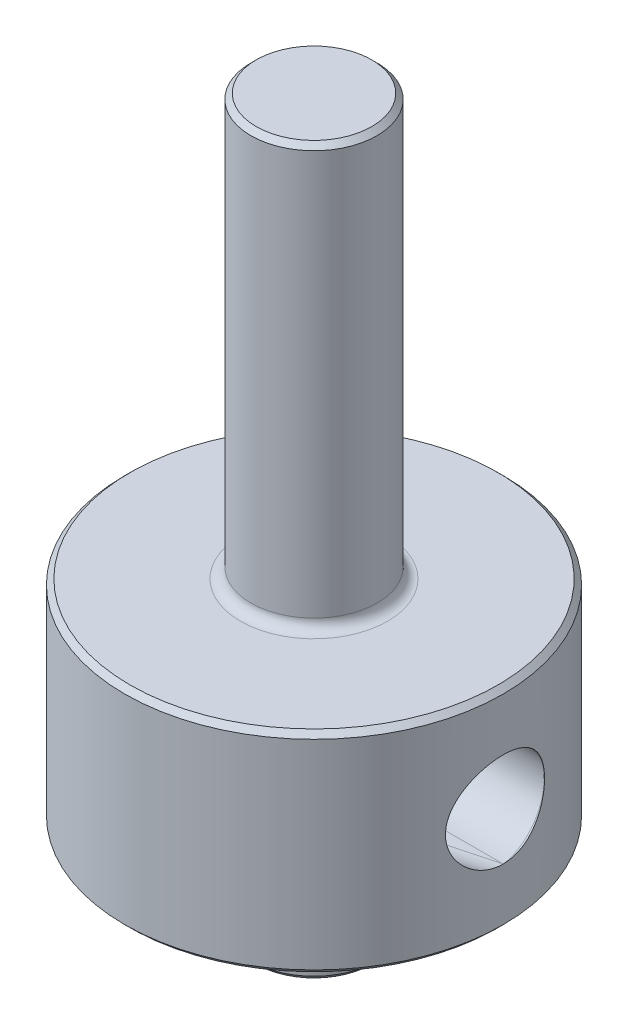
ISO-10303-21;
HEADER;
FILE_DESCRIPTION(('STEP AP214'),'2;1');
FILE_NAME('part.step','',(''),(''),'','','');
FILE_SCHEMA(('AUTOMOTIVE_DESIGN { 1 0 10303 214 1 1 1 1 }'));
ENDSEC;
DATA;
#1=APPLICATION_CONTEXT('core data for automotive mechanical design processes');
#2=APPLICATION_PROTOCOL_DEFINITION('international standard','automotive_design',2000,#1);
#3=PRODUCT_CONTEXT('',#1,'mechanical');
#4=PRODUCT('Part','Part','',(#3));
#5=PRODUCT_RELATED_PRODUCT_CATEGORY('part','',(#4));
#6=PRODUCT_DEFINITION_FORMATION('','',#4);
#7=PRODUCT_DEFINITION_CONTEXT('part definition',#1,'design');
#8=PRODUCT_DEFINITION('design','',#6,#7);
#9=PRODUCT_DEFINITION_SHAPE('','',#8);
#10=(LENGTH_UNIT() NAMED_UNIT(*) SI_UNIT(.MILLI.,.METRE.));
#11=(NAMED_UNIT(*) PLANE_ANGLE_UNIT() SI_UNIT($,.RADIAN.));
#12=(NAMED_UNIT(*) SI_UNIT($,.STERADIAN.) SOLID_ANGLE_UNIT());
#13=UNCERTAINTY_MEASURE_WITH_UNIT(LENGTH_MEASURE(1.E-05),#10,'distance_accuracy_value','');
#14=(GEOMETRIC_REPRESENTATION_CONTEXT(3) GLOBAL_UNCERTAINTY_ASSIGNED_CONTEXT((#13)) GLOBAL_UNIT_ASSIGNED_CONTEXT((#10,
#11,#12)) REPRESENTATION_CONTEXT('',''));
#15=CARTESIAN_POINT('',(0.,0.,0.));
#16=DIRECTION('',(0.,0.,1.));
#17=DIRECTION('',(1.,0.,0.));
#18=AXIS2_PLACEMENT_3D('',#15,#16,#17);
#19=CARTESIAN_POINT('',(11.25,0.,-0.602885682970027));
#20=DIRECTION('',(-0.965925826289068,0.,0.258819045102521));
#21=DIRECTION('',(0.258819045102521,0.,0.965925826289068));
#22=AXIS2_PLACEMENT_3D('',#19,#20,#21);
#23=CYLINDRICAL_SURFACE('',#22,2.25);
#24=DIRECTION('',(0.965925826289068,0.,-0.258819045102521));
#25=VECTOR('',#24,1.);
#26=CARTESIAN_POINT('',(-10.4287614698095,-2.25,5.20592094577239));
#27=LINE('',#26,#25);
#28=CARTESIAN_POINT('',(-7.79422863405994,-2.25,4.50000000000001));
#29=VERTEX_POINT('',#28);
#30=CARTESIAN_POINT('',(9.,-2.25,0.));
#31=VERTEX_POINT('',#30);
#32=EDGE_CURVE('E66',#29,#31,#27,.T.);
#33=ORIENTED_EDGE('',*,*,#32,.F.);
#34=CARTESIAN_POINT('',(-6.2986309684237,0.,6.42862721921359));
#35=CARTESIAN_POINT('',(-6.29863572562921,0.115420645557257,6.42862440706099));
#36=CARTESIAN_POINT('',(-6.3060602838156,0.230878962906398,6.42137370973188));
#37=CARTESIAN_POINT('',(-6.33512109848462,0.458218917145718,6.39270188036306));
#38=CARTESIAN_POINT('',(-6.3567683340453,0.570097720835036,6.37126980103204));
#39=CARTESIAN_POINT('',(-6.41242453029494,0.78670447934925,6.31524720562879));
#40=CARTESIAN_POINT('',(-6.44638221658226,0.891459984994621,6.2807112412774));
#41=CARTESIAN_POINT('',(-6.52441532590811,1.09212368629617,6.19960971245666));
#42=CARTESIAN_POINT('',(-6.56849300705771,1.18802990067239,6.15304146288881));
#43=CARTESIAN_POINT('',(-6.66787542719835,1.37599197932501,6.04526066182345));
#44=CARTESIAN_POINT('',(-6.72376022801728,1.46727267152965,5.98323478487839));
#45=CARTESIAN_POINT('',(-6.84174874506253,1.63651923315656,5.8479513900165));
#46=CARTESIAN_POINT('',(-6.90385527941814,1.71447902523652,5.77468877437664));
#47=CARTESIAN_POINT('',(-7.03939861788815,1.86424788131121,5.60888743463547));
#48=CARTESIAN_POINT('',(-7.11330801596242,1.93424855635128,5.51509447487221));
#49=CARTESIAN_POINT('',(-7.26276858582111,2.05452364569838,5.31673000401393));
#50=CARTESIAN_POINT('',(-7.33832026687979,2.1047918461138,5.2121551106831));
#51=CARTESIAN_POINT('',(-7.49057807446588,2.18518458802696,4.99097133267823));
#52=CARTESIAN_POINT('',(-7.56724722608848,2.2146353310375,4.87408964345249));
#53=CARTESIAN_POINT('',(-7.71646007617075,2.24913379886119,4.63423781835183));
#54=CARTESIAN_POINT('',(-7.78900533974565,2.25419084360776,4.51127002589661));
#55=CARTESIAN_POINT('',(-7.92385182822738,2.23921005722015,4.26974209030992));
#56=CARTESIAN_POINT('',(-7.98649124915509,2.22047892995192,4.15129057209001));
#57=CARTESIAN_POINT('',(-8.10419519406083,2.15996401217146,3.91653502097405));
#58=CARTESIAN_POINT('',(-8.15926253547756,2.11818882510589,3.80023020334988));
#59=CARTESIAN_POINT('',(-8.25776113353527,2.01560967239164,3.58092038777548));
#60=CARTESIAN_POINT('',(-8.30169093853679,1.95609127547807,3.47753592764894));
#61=CARTESIAN_POINT('',(-8.38164675783941,1.81895528829501,3.28014439330143));
#62=CARTESIAN_POINT('',(-8.4176735688114,1.74133952398132,3.18613637439842));
#63=CARTESIAN_POINT('',(-8.4813766537205,1.57178662880977,3.0124201997295));
#64=CARTESIAN_POINT('',(-8.50919398505658,1.48013832272008,2.93248136388814));
#65=CARTESIAN_POINT('',(-8.55778682532547,1.28408324493627,2.78749818442494));
#66=CARTESIAN_POINT('',(-8.5785620965331,1.17967604269037,2.72245434365095));
#67=CARTESIAN_POINT('',(-8.61377201375056,0.960065530946159,2.608929002455));
#68=CARTESIAN_POINT('',(-8.62815045340775,0.844776908229934,2.56059511952854));
#69=CARTESIAN_POINT('',(-8.65083340110135,0.607411382763265,2.48288750415837));
#70=CARTESIAN_POINT('',(-8.65913768828506,0.48533423335953,2.45351446112445));
#71=CARTESIAN_POINT('',(-8.67008048728678,0.236857570319108,2.41456499172959));
#72=CARTESIAN_POINT('',(-8.67267544790419,0.110432252928291,2.40514075696676));
#73=CARTESIAN_POINT('',(-8.67219751366162,-0.142268545365695,2.40686318857274));
#74=CARTESIAN_POINT('',(-8.66912451553204,-0.268544023496865,2.41801022974793));
#75=CARTESIAN_POINT('',(-8.65715387573318,-0.51751785461279,2.46052203867228));
#76=CARTESIAN_POINT('',(-8.64824925913011,-0.640211740022708,2.49191101619238));
#77=CARTESIAN_POINT('',(-8.62421236615811,-0.878377270072895,2.57386329992728));
#78=CARTESIAN_POINT('',(-8.60908000496078,-0.993848816312671,2.6244268673193));
#79=CARTESIAN_POINT('',(-8.57205213944146,-1.21415256544937,2.74294663140657));
#80=CARTESIAN_POINT('',(-8.55016367391666,-1.31899569116797,2.81088471402045));
#81=CARTESIAN_POINT('',(-8.49904486992793,-1.51515452308034,2.96185190294187));
#82=CARTESIAN_POINT('',(-8.46981504685822,-1.60647117817417,3.04487994975732));
#83=CARTESIAN_POINT('',(-8.40384326654009,-1.77231366502419,3.22246844850753));
#84=CARTESIAN_POINT('',(-8.36716006476566,-1.84696178407205,3.31693649876167));
#85=CARTESIAN_POINT('',(-8.28606008973115,-1.97828129373805,3.51462690249678));
#86=CARTESIAN_POINT('',(-8.24164420023817,-2.03495473659138,3.61784825487416));
#87=CARTESIAN_POINT('',(-8.14587050991866,-2.12853459341272,3.82858464031527));
#88=CARTESIAN_POINT('',(-8.09457748565701,-2.1656111713848,3.93605369911621));
#89=CARTESIAN_POINT('',(-7.98560105577117,-2.2201622548549,4.15269515826185));
#90=CARTESIAN_POINT('',(-7.92791726302396,-2.23763557216455,4.26186766144874));
#91=CARTESIAN_POINT('',(-7.8064627399753,-2.2532286711866,4.48051702474105));
#92=CARTESIAN_POINT('',(-7.74260781604153,-2.25102691326248,4.58996960492615));
#93=CARTESIAN_POINT('',(-7.61133141525705,-2.22723790138716,4.80452612877819));
#94=CARTESIAN_POINT('',(-7.54390907227507,-2.20564591918363,4.90962900524241));
#95=CARTESIAN_POINT('',(-7.40368700760956,-2.14247693844326,5.11880139853706));
#96=CARTESIAN_POINT('',(-7.33079536390484,-2.09986710762043,5.22249687911003));
#97=CARTESIAN_POINT('',(-7.18566990287537,-1.99573590270148,5.4204461433094));
#98=CARTESIAN_POINT('',(-7.11343636939443,-1.9342067325446,5.51469601343077));
#99=CARTESIAN_POINT('',(-6.96808985738204,-1.78946346248777,5.6973807162314));
#100=CARTESIAN_POINT('',(-6.89518353138152,-1.70517091423079,5.78512871402776));
#101=CARTESIAN_POINT('',(-6.75667498207226,-1.51863287423206,5.94631447067187));
#102=CARTESIAN_POINT('',(-6.69107582137067,-1.41637990076989,6.01974623884784));
#103=CARTESIAN_POINT('',(-6.57183008781377,-1.19703132919625,6.14969612074954));
#104=CARTESIAN_POINT('',(-6.51807249243096,-1.08009130507524,6.20637320763919));
#105=CARTESIAN_POINT('',(-6.42605821431225,-0.833521771282112,6.30160344845743));
#106=CARTESIAN_POINT('',(-6.38776882517395,-0.703919763209804,6.34019487118341));
#107=CARTESIAN_POINT('',(-6.33934183170501,-0.477861263387974,6.38854526595828));
#108=CARTESIAN_POINT('',(-6.32415889206565,-0.38356198653444,6.40353131951988));
#109=CARTESIAN_POINT('',(-6.30380294632094,-0.192850152597827,6.42357200922269));
#110=CARTESIAN_POINT('',(-6.29862699360223,-0.096438226055408,6.42862956887129));
#111=CARTESIAN_POINT('',(-6.2986309684237,0.,6.42862721921359));
#112=B_SPLINE_CURVE_WITH_KNOTS('',3,(#34,#35,#36,#37,#38,#39,#40,#41,#42,#43,#44,#45,#46,#47,
#48,#49,#50,#51,#52,#53,#54,#55,#56,#57,#58,#59,#60,#61,#62,#63,#64,#65,#66,#67,#68,#69,#70,#71,
#72,#73,#74,#75,#76,#77,#78,#79,#80,#81,#82,#83,#84,#85,#86,#87,#88,#89,#90,#91,#92,#93,#94,#95,
#96,#97,#98,#99,#100,#101,#102,#103,#104,#105,#106,#107,#108,#109,#110,#111),.UNSPECIFIED.,.T.,
.F.,(4,2,2,2,2,2,2,2,2,2,2,2,2,2,2,2,2,2,2,2,2,2,2,2,2,2,2,2,2,2,2,2,2,2,2,2,2,2,4),(0.,
0.345877961457703,0.692023234739048,1.03674303415902,1.38153982703779,1.75117699978304,
2.12098236297531,2.53438092029154,2.94790955541439,3.37427601824992,3.8004795692583,
4.204252580168,4.6078749452831,4.98738996171283,5.36686670307259,5.73938241737213,
6.11191070576972,6.48765054778276,6.86340405080125,7.24201403637019,7.62063092023952,
7.99970147963442,8.37877720253762,8.757459313711,9.13611484723242,9.51189379136419,
9.88762981596775,10.2600472924912,10.6324873406787,11.0110249766264,11.389654942997,
11.7890874589759,12.1886847895261,12.6122260505673,13.0359441651727,13.455502400953,
13.8741688086731,14.1632477952196,14.452241647867),.UNSPECIFIED.);
#113=CARTESIAN_POINT('',(-7.79422863405994,2.25,4.50000000000001));
#114=VERTEX_POINT('',#113);
#115=EDGE_CURVE('E98',#29,#114,#112,.T.);
#116=ORIENTED_EDGE('',*,*,#115,.T.);
#117=DIRECTION('',(0.965925826289068,0.,-0.258819045102521));
#118=VECTOR('',#117,1.);
#119=CARTESIAN_POINT('',(-10.4287614698095,2.25,5.20592094577239));
#120=LINE('',#119,#118);
#121=CARTESIAN_POINT('',(9.,2.25,0.));
#122=VERTEX_POINT('',#121);
#123=EDGE_CURVE('E94',#114,#122,#120,.T.);
#124=ORIENTED_EDGE('',*,*,#123,.T.);
#125=CARTESIAN_POINT('',(8.66908803732511,0.,2.41803899908722));
#126=CARTESIAN_POINT('',(8.66909075110963,-0.115420645557257,2.41803418508887));
#127=CARTESIAN_POINT('',(8.67189525844636,-0.230878962906399,2.40804261791352));
#128=CARTESIAN_POINT('',(8.68272674751999,-0.458218917145718,2.36868167797264));
#129=CARTESIAN_POINT('',(8.69075776377174,-0.570097720835037,2.33929733503571));
#130=CARTESIAN_POINT('',(8.71094614590031,-0.786704479349251,2.26295224610574));
#131=CARTESIAN_POINT('',(8.72308638270318,-0.891459984994622,2.21606438048958));
#132=CARTESIAN_POINT('',(8.75011427330529,-1.09212368629617,2.10681184158214));
#133=CARTESIAN_POINT('',(8.76500254013682,-1.18802990067239,2.04444371387181));
#134=CARTESIAN_POINT('',(8.79717984013551,-1.37599197932501,1.90141159203865));
#135=CARTESIAN_POINT('',(8.81456455885762,-1.46727267152965,1.81975320650276));
#136=CARTESIAN_POINT('',(8.84910391454271,-1.63651923315656,1.64360009131953));
#137=CARTESIAN_POINT('',(8.86625844321575,-1.71447902523652,1.54909953784991));
#138=CARTESIAN_POINT('',(8.90074174777394,-1.86424788131121,1.33773969641756));
#139=CARTESIAN_POINT('',(8.91785268420305,-1.93424855635128,1.21955791152931));
#140=CARTESIAN_POINT('',(8.94810709913564,-2.05452364569838,0.973038955628435));
#141=CARTESIAN_POINT('',(8.96124932756565,-2.1047918461138,0.844698600876546));
#142=CARTESIAN_POINT('',(8.9825165678573,-2.18518458802696,0.577018926426272));
#143=CARTESIAN_POINT('',(8.99047315623619,-2.21463533103751,0.437461838508236));
#144=CARTESIAN_POINT('',(8.99976936242818,-2.24913379886119,0.155137639785871));
#145=CARTESIAN_POINT('',(9.00111150738068,-2.25419084360776,0.0123717758849108));
#146=CARTESIAN_POINT('',(8.99712802422364,-2.23921005722015,-0.264220796297641));
#147=CARTESIAN_POINT('',(8.99214959491542,-2.22047892995192,-0.398122530656776));
#148=CARTESIAN_POINT('',(8.97670642577146,-2.15996401217146,-0.660278774055481));
#149=CARTESIAN_POINT('',(8.96624373354513,-2.11818882510589,-0.788535371408894));
#150=CARTESIAN_POINT('',(8.94189111391307,-2.01560967239164,-1.02771254202446));
#151=CARTESIAN_POINT('',(8.92824321096441,-1.95609127547807,-1.13921101335134));
#152=CARTESIAN_POINT('',(8.89879121448712,-1.81895528829501,-1.35013500623958));
#153=CARTESIAN_POINT('',(8.8829873385547,-1.74133952398132,-1.44956174425504));
#154=CARTESIAN_POINT('',(8.85129774105095,-1.57178662880977,-1.63185590702113));
#155=CARTESIAN_POINT('',(8.83541883873281,-1.48013832272008,-1.71499363527673));
#156=CARTESIAN_POINT('',(8.80500988311611,-1.28408324493627,-1.86484917194776));
#157=CARTESIAN_POINT('',(8.79047987536543,-1.17967604269037,-1.93156642602155));
#158=CARTESIAN_POINT('',(8.76420988754292,-0.960065530946158,-2.04748721407927));
#159=CARTESIAN_POINT('',(8.7524950400896,-0.844776908229933,-2.09653480438572));
#160=CARTESIAN_POINT('',(8.73328524133988,-0.607411382763264,-2.1751730472106));
#161=CARTESIAN_POINT('',(8.72579044348435,-0.485334233359529,-2.20476299225628));
#162=CARTESIAN_POINT('',(8.7157924507109,-0.236857570319107,-2.24396562171702));
#163=CARTESIAN_POINT('',(8.71332763514599,-0.110432252928291,-2.25342472874156));
#164=CARTESIAN_POINT('',(8.71377494775357,0.142268545365696,-2.25169409209321));
#165=CARTESIAN_POINT('',(8.71668717389518,0.268544023496866,-2.24050397219368));
#166=CARTESIAN_POINT('',(8.72757620019198,0.517517854612791,-2.19770234580494));
#167=CARTESIAN_POINT('',(8.73555906476282,0.64021174002271,-2.16606638557217));
#168=CARTESIAN_POINT('',(8.75571864668846,0.878377270072896,-2.08307517947359));
#169=CARTESIAN_POINT('',(8.76789542116834,0.993848816312672,-2.03171966500748));
#170=CARTESIAN_POINT('',(8.79508823102433,1.21415256544937,-1.91056460569769));
#171=CARTESIAN_POINT('',(8.81010130513694,1.31899569116797,-1.84078426750727));
#172=CARTESIAN_POINT('',(8.84131471673233,1.51515452308034,-1.68448344476903));
#173=CARTESIAN_POINT('',(8.85751497081356,1.60647117817417,-1.5979641354654));
#174=CARTESIAN_POINT('',(8.88917598250028,1.77231366502419,-1.41118209396871));
#175=CARTESIAN_POINT('',(8.90464142299854,1.84696178407205,-1.31102876171542));
#176=CARTESIAN_POINT('',(8.93325198623993,1.97828129373805,-1.09927386247916));
#177=CARTESIAN_POINT('',(8.94639737379601,2.03495473659138,-0.987673604360878));
#178=CARTESIAN_POINT('',(8.96882311768569,2.12853459341272,-0.757283695907411));
#179=CARTESIAN_POINT('',(8.97813658503864,2.1656111713848,-0.638566248734169));
#180=CARTESIAN_POINT('',(8.99208095791658,2.2201622548549,-0.396461026658194));
#181=CARTESIAN_POINT('',(8.99671157960431,2.23763557216455,-0.273072969130007));
#182=CARTESIAN_POINT('',(9.00085355888581,2.2532286711866,-0.0229898044732395));
#183=CARTESIAN_POINT('',(9.00027986269499,2.25102691326248,0.103726372443697));
#184=CARTESIAN_POINT('',(8.99386942662426,2.22723790138717,0.355175973039477));
#185=CARTESIAN_POINT('',(8.98803140305131,2.20564591918363,0.479908905559302));
#186=CARTESIAN_POINT('',(8.9711817295272,2.14247693844326,0.731168544255609));
#187=CARTESIAN_POINT('',(8.9599034546418,2.09986710762043,0.857417286541805));
#188=CARTESIAN_POINT('',(8.93319575075403,1.99573590270148,1.10140910851363));
#189=CARTESIAN_POINT('',(8.91776461081511,1.9342067325446,1.21914865708259));
#190=CARTESIAN_POINT('',(8.88323319046123,1.78946346248777,1.45003150659694));
#191=CARTESIAN_POINT('',(8.86396845894638,1.70517091423079,1.56247666482007));
#192=CARTESIAN_POINT('',(8.82460941492528,1.51863287423205,1.77132189945671));
#193=CARTESIAN_POINT('',(8.80451475937875,1.41637990076989,1.86771525649271));
#194=CARTESIAN_POINT('',(8.76621986577641,1.19703132919625,2.03987802221683));
#195=CARTESIAN_POINT('',(8.74800296597337,1.08009130507523,2.11584061696716));
#196=CARTESIAN_POINT('',(8.71593138402079,0.83352177128211,2.24431956378361));
#197=CARTESIAN_POINT('',(8.70206751169463,0.703919763209803,2.29688541080165));
#198=CARTESIAN_POINT('',(8.68430370250905,0.477861263387973,2.36297157769416));
#199=CARTESIAN_POINT('',(8.67864791785805,0.383561986534439,2.38354135060067));
#200=CARTESIAN_POINT('',(8.67103949657648,0.192850152597826,2.41107506986501));
#201=CARTESIAN_POINT('',(8.66908576985758,0.0964382260554076,2.41804302136122));
#202=CARTESIAN_POINT('',(8.66908803732511,0.,2.41803899908722));
#203=B_SPLINE_CURVE_WITH_KNOTS('',3,(#125,#126,#127,#128,#129,#130,#131,#132,#133,#134,#135,
#136,#137,#138,#139,#140,#141,#142,#143,#144,#145,#146,#147,#148,#149,#150,#151,#152,#153,#154,
#155,#156,#157,#158,#159,#160,#161,#162,#163,#164,#165,#166,#167,#168,#169,#170,#171,#172,#173,
#174,#175,#176,#177,#178,#179,#180,#181,#182,#183,#184,#185,#186,#187,#188,#189,#190,#191,#192,
#193,#194,#195,#196,#197,#198,#199,#200,#201,#202),.UNSPECIFIED.,.T.,.F.,(4,2,2,2,2,2,2,2,2,2,2,
2,2,2,2,2,2,2,2,2,2,2,2,2,2,2,2,2,2,2,2,2,2,2,2,2,2,2,4),(0.,0.345877961457704,
0.692023234739048,1.03674303415902,1.38153982703779,1.75117699978304,2.12098236297532,
2.53438092029155,2.94790955541439,3.37427601824992,3.8004795692583,4.204252580168,
4.6078749452831,4.98738996171283,5.36686670307259,5.73938241737213,6.11191070576972,
6.48765054778276,6.86340405080125,7.24201403637019,7.62063092023952,7.99970147963442,
8.37877720253762,8.75745931371099,9.13611484723242,9.51189379136419,9.88762981596774,
10.2600472924912,10.6324873406787,11.0110249766264,11.389654942997,11.7890874589759,
12.1886847895261,12.6122260505673,13.0359441651727,13.455502400953,13.8741688086731,
14.1632477952196,14.452241647867),.UNSPECIFIED.);
#204=EDGE_CURVE('E93',#122,#31,#203,.T.);
#205=ORIENTED_EDGE('',*,*,#204,.T.);
#206=EDGE_LOOP('',(#33,#116,#124,#205));
#207=FACE_BOUND('',#206,.T.);
#208=ADVANCED_FACE('F34',(#207),#23,.F.);
#209=CARTESIAN_POINT('',(3.,-9.5,0.));
#210=DIRECTION('',(0.,-1.,0.));
#211=DIRECTION('',(0.,0.,-1.));
#212=AXIS2_PLACEMENT_3D('',#209,#210,#211);
#213=PLANE('',#212);
#214=CARTESIAN_POINT('',(0.,-9.5,0.));
#215=DIRECTION('',(0.,-1.,0.));
#216=DIRECTION('',(0.,0.,-1.));
#217=AXIS2_PLACEMENT_3D('',#214,#215,#216);
#218=CIRCLE('',#217,2.75);
#219=CARTESIAN_POINT('',(0.,-9.5,-2.75));
#220=VERTEX_POINT('',#219);
#221=EDGE_CURVE('E137',#220,#220,#218,.T.);
#222=ORIENTED_EDGE('',*,*,#221,.T.);
#223=EDGE_LOOP('',(#222));
#224=FACE_BOUND('',#223,.T.);
#225=ADVANCED_FACE('F182',(#224),#213,.T.);
#226=CARTESIAN_POINT('',(0.,25.,0.));
#227=DIRECTION('',(0.,1.,0.));
#228=DIRECTION('',(0.,0.,1.));
#229=AXIS2_PLACEMENT_3D('',#226,#227,#228);
#230=PLANE('',#229);
#231=CARTESIAN_POINT('',(0.,25.,0.));
#232=DIRECTION('',(0.,1.,0.));
#233=DIRECTION('',(0.,0.,1.));
#234=AXIS2_PLACEMENT_3D('',#231,#232,#233);
#235=CIRCLE('',#234,2.75);
#236=CARTESIAN_POINT('',(0.,25.,2.75));
#237=VERTEX_POINT('',#236);
#238=EDGE_CURVE('E146',#237,#237,#235,.T.);
#239=ORIENTED_EDGE('',*,*,#238,.T.);
#240=EDGE_LOOP('',(#239));
#241=FACE_BOUND('',#240,.T.);
#242=ADVANCED_FACE('F186',(#241),#230,.T.);
#243=CARTESIAN_POINT('',(0.,0.,0.));
#244=DIRECTION('',(0.,-1.,0.));
#245=DIRECTION('',(0.,0.,-1.));
#246=AXIS2_PLACEMENT_3D('',#243,#244,#245);
#247=CYLINDRICAL_SURFACE('',#246,3.);
#248=CARTESIAN_POINT('',(0.,24.75,0.));
#249=DIRECTION('',(0.,1.,0.));
#250=DIRECTION('',(0.,0.,1.));
#251=AXIS2_PLACEMENT_3D('',#248,#249,#250);
#252=CIRCLE('',#251,3.);
#253=CARTESIAN_POINT('',(0.,24.75,3.));
#254=VERTEX_POINT('',#253);
#255=EDGE_CURVE('E143',#254,#254,#252,.F.);
#256=ORIENTED_EDGE('',*,*,#255,.T.);
#257=EDGE_LOOP('',(#256));
#258=FACE_BOUND('',#257,.T.);
#259=CARTESIAN_POINT('',(0.,5.5,0.));
#260=DIRECTION('',(0.,1.,0.));
#261=DIRECTION('',(0.,0.,1.));
#262=AXIS2_PLACEMENT_3D('',#259,#260,#261);
#263=CIRCLE('',#262,3.);
#264=CARTESIAN_POINT('',(0.,5.5,3.));
#265=VERTEX_POINT('',#264);
#266=EDGE_CURVE('E134',#265,#265,#263,.T.);
#267=ORIENTED_EDGE('',*,*,#266,.T.);
#268=EDGE_LOOP('',(#267));
#269=FACE_BOUND('',#268,.T.);
#270=ADVANCED_FACE('F192',(#258,#269),#247,.T.);
#271=CARTESIAN_POINT('',(9.,5.,0.));
#272=DIRECTION('',(0.,1.,0.));
#273=DIRECTION('',(0.,0.,1.));
#274=AXIS2_PLACEMENT_3D('',#271,#272,#273);
#275=PLANE('',#274);
#276=CARTESIAN_POINT('',(0.,5.,0.));
#277=DIRECTION('',(0.,1.,0.));
#278=DIRECTION('',(0.,0.,1.));
#279=AXIS2_PLACEMENT_3D('',#276,#277,#278);
#280=CIRCLE('',#279,8.75);
#281=CARTESIAN_POINT('',(0.,5.,8.75));
#282=VERTEX_POINT('',#281);
#283=EDGE_CURVE('E11',#282,#282,#280,.T.);
#284=ORIENTED_EDGE('',*,*,#283,.T.);
#285=EDGE_LOOP('',(#284));
#286=FACE_BOUND('',#285,.T.);
#287=CARTESIAN_POINT('',(0.,5.,0.));
#288=DIRECTION('',(0.,1.,0.));
#289=DIRECTION('',(0.,0.,1.));
#290=AXIS2_PLACEMENT_3D('',#287,#288,#289);
#291=CIRCLE('',#290,3.5);
#292=CARTESIAN_POINT('',(0.,5.,3.5));
#293=VERTEX_POINT('',#292);
#294=EDGE_CURVE('E131',#293,#293,#291,.F.);
#295=ORIENTED_EDGE('',*,*,#294,.T.);
#296=EDGE_LOOP('',(#295));
#297=FACE_BOUND('',#296,.T.);
#298=ADVANCED_FACE('F214',(#286,#297),#275,.T.);
#299=CARTESIAN_POINT('',(0.,0.,0.));
#300=DIRECTION('',(0.,-1.,0.));
#301=DIRECTION('',(0.,0.,-1.));
#302=AXIS2_PLACEMENT_3D('',#299,#300,#301);
#303=CYLINDRICAL_SURFACE('',#302,9.);
#304=CARTESIAN_POINT('',(0.,-4.75,0.));
#305=DIRECTION('',(0.,-1.,0.));
#306=DIRECTION('',(0.,0.,-1.));
#307=AXIS2_PLACEMENT_3D('',#304,#305,#306);
#308=CIRCLE('',#307,9.);
#309=CARTESIAN_POINT('',(0.,-4.75,-9.));
#310=VERTEX_POINT('',#309);
#311=EDGE_CURVE('E42',#310,#310,#308,.F.);
#312=ORIENTED_EDGE('',*,*,#311,.T.);
#313=EDGE_LOOP('',(#312));
#314=FACE_BOUND('',#313,.T.);
#315=CARTESIAN_POINT('',(0.,4.75,0.));
#316=DIRECTION('',(0.,1.,0.));
#317=DIRECTION('',(0.,0.,1.));
#318=AXIS2_PLACEMENT_3D('',#315,#316,#317);
#319=CIRCLE('',#318,9.);
#320=CARTESIAN_POINT('',(0.,4.75,9.));
#321=VERTEX_POINT('',#320);
#322=EDGE_CURVE('E152',#321,#321,#319,.F.);
#323=ORIENTED_EDGE('',*,*,#322,.T.);
#324=EDGE_LOOP('',(#323));
#325=FACE_BOUND('',#324,.T.);
#326=CARTESIAN_POINT('',(0.,-2.25,0.));
#327=DIRECTION('',(0.,-1.,0.));
#328=DIRECTION('',(0.,0.,-1.));
#329=AXIS2_PLACEMENT_3D('',#326,#327,#328);
#330=CIRCLE('',#329,9.);
#331=CARTESIAN_POINT('',(-9.,-2.25,0.));
#332=VERTEX_POINT('',#331);
#333=EDGE_CURVE('E49',#332,#29,#330,.F.);
#334=ORIENTED_EDGE('',*,*,#333,.F.);
#335=CARTESIAN_POINT('',(-8.71421252896669,0.,2.25));
#336=CARTESIAN_POINT('',(-8.71421490079074,0.124245675833919,2.24999647073377));
#337=CARTESIAN_POINT('',(-8.71689875413138,0.24853040881067,2.23967362094789));
#338=CARTESIAN_POINT('',(-8.72731675793308,0.493530820356158,2.19872081291741));
#339=CARTESIAN_POINT('',(-8.73505384759467,0.614244379021367,2.16807903606789));
#340=CARTESIAN_POINT('',(-8.75464852136535,0.848523184368464,2.08754207966884));
#341=CARTESIAN_POINT('',(-8.76650078421412,0.962097439847137,2.03767175506904));
#342=CARTESIAN_POINT('',(-8.79298372825883,1.17927976728589,1.92016902713525));
#343=CARTESIAN_POINT('',(-8.8076145274064,1.2828874158722,1.85253586970462));
#344=CARTESIAN_POINT('',(-8.83836644720063,1.47947548073599,1.69983758458069));
#345=CARTESIAN_POINT('',(-8.85451137860731,1.57220424031504,1.61445319893365));
#346=CARTESIAN_POINT('',(-8.88626587963764,1.74218525492431,1.4293638576906));
#347=CARTESIAN_POINT('',(-8.9018753990975,1.81943606305957,1.32965756476228));
#348=CARTESIAN_POINT('',(-8.93106373968524,1.95729792086815,1.11703068097106));
#349=CARTESIAN_POINT('',(-8.94461118660533,2.01766174934532,1.00394511857561));
#350=CARTESIAN_POINT('',(-8.96787730733386,2.11842867973777,0.768836865863486));
#351=CARTESIAN_POINT('',(-8.9775965460091,2.15883472672396,0.646815497212746));
#352=CARTESIAN_POINT('',(-8.99194282963362,2.21773305112073,0.399922882878745));
#353=CARTESIAN_POINT('',(-8.99666904459883,2.23665267989392,0.275159447594078));
#354=CARTESIAN_POINT('',(-9.00084234696568,2.253382541348,0.0241459373364922));
#355=CARTESIAN_POINT('',(-9.00029021487034,2.25119589498864,-0.102103915084262));
#356=CARTESIAN_POINT('',(-8.9940428545818,2.22608263477487,-0.349542556137872));
#357=CARTESIAN_POINT('',(-8.98846202106784,2.20361730745153,-0.470781485102401));
#358=CARTESIAN_POINT('',(-8.97291752872371,2.13932585695635,-0.707711056680794));
#359=CARTESIAN_POINT('',(-8.96295363658607,2.09749870316033,-0.823401403583486));
#360=CARTESIAN_POINT('',(-8.93958758730796,1.99529768638164,-1.04716508287906));
#361=CARTESIAN_POINT('',(-8.9261551772551,1.93475965980443,-1.15516014697463));
#362=CARTESIAN_POINT('',(-8.89730913428723,1.79697988879537,-1.3596201502661));
#363=CARTESIAN_POINT('',(-8.88189515687385,1.71973523829544,-1.45608307894239));
#364=CARTESIAN_POINT('',(-8.85027342392421,1.54826213221587,-1.63749157894115));
#365=CARTESIAN_POINT('',(-8.83405547572768,1.45363059688703,-1.72205477791919));
#366=CARTESIAN_POINT('',(-8.80303539165594,1.25136002381375,-1.8741968459168));
#367=CARTESIAN_POINT('',(-8.7882333219746,1.14372037845801,-1.94177492110356));
#368=CARTESIAN_POINT('',(-8.76168447146387,0.917738969266025,-2.05827329030082));
#369=CARTESIAN_POINT('',(-8.74995285345307,0.799347842718476,-2.10710152568351));
#370=CARTESIAN_POINT('',(-8.73106776133802,0.55567307873084,-2.18404264643186));
#371=CARTESIAN_POINT('',(-8.7239133075846,0.430390922413862,-2.21215996474439));
#372=CARTESIAN_POINT('',(-8.71519820406711,0.180036448623073,-2.24624667479933));
#373=CARTESIAN_POINT('',(-8.7134948007924,0.0550459859930781,-2.25278142652721));
#374=CARTESIAN_POINT('',(-8.71548609028223,-0.194239742926729,-2.24506529146364));
#375=CARTESIAN_POINT('',(-8.7191802861327,-0.318535072154498,-2.23081631806482));
#376=CARTESIAN_POINT('',(-8.73141373786482,-0.560802838453716,-2.18243291754443));
#377=CARTESIAN_POINT('',(-8.73987273218279,-0.678845453912279,-2.14862766145371));
#378=CARTESIAN_POINT('',(-8.76060646436524,-0.907588312067995,-2.06245627350342));
#379=CARTESIAN_POINT('',(-8.77288165421767,-1.01828768315021,-2.01008794294125));
#380=CARTESIAN_POINT('',(-8.8001652338596,-1.23159715008021,-1.88709360114294));
#381=CARTESIAN_POINT('',(-8.8152225174652,-1.33400595603868,-1.81612957845208));
#382=CARTESIAN_POINT('',(-8.84625374764002,-1.52566952652133,-1.65838565910251));
#383=CARTESIAN_POINT('',(-8.86222784455476,-1.6149221249851,-1.57160316331224));
#384=CARTESIAN_POINT('',(-8.89377662728596,-1.78002993831383,-1.38209112221564));
#385=CARTESIAN_POINT('',(-8.90933131855692,-1.85549405629392,-1.27901689319608));
#386=CARTESIAN_POINT('',(-8.93787494952321,-1.98804228025613,-1.06133103606302));
#387=CARTESIAN_POINT('',(-8.95086402303554,-2.04512734494739,-0.94672001015458));
#388=CARTESIAN_POINT('',(-8.97273104164493,-2.13880143107514,-0.710005953894954));
#389=CARTESIAN_POINT('',(-8.98163847020169,-2.17553785594116,-0.587964107312736));
#390=CARTESIAN_POINT('',(-8.9944676405621,-2.22791430114757,-0.339186960717317));
#391=CARTESIAN_POINT('',(-8.99839034454079,-2.24355839286514,-0.212452571342792));
#392=CARTESIAN_POINT('',(-9.00076881169814,-2.25307707654496,0.0384379344974772));
#393=CARTESIAN_POINT('',(-8.99936952479974,-2.24752884546467,0.162571110673549));
#394=CARTESIAN_POINT('',(-8.99158267029248,-2.21614238858771,0.40807686693319));
#395=CARTESIAN_POINT('',(-8.9851952510363,-2.19030476622037,0.529449529007089));
#396=CARTESIAN_POINT('',(-8.9681722392125,-2.11938250551556,0.765384830200741));
#397=CARTESIAN_POINT('',(-8.95755970130383,-2.07440223004265,0.879980612806941));
#398=CARTESIAN_POINT('',(-8.9332040005573,-1.96656619720596,1.10006336934365));
#399=CARTESIAN_POINT('',(-8.91946044312205,-1.90370818649141,1.20554919284767));
#400=CARTESIAN_POINT('',(-8.88991311780646,-1.7601407235087,1.40715433895243));
#401=CARTESIAN_POINT('',(-8.87406788118745,-1.67903967846638,1.50298872367125));
#402=CARTESIAN_POINT('',(-8.84228960378677,-1.50204858305097,1.67988379561538));
#403=CARTESIAN_POINT('',(-8.8263565417643,-1.40615478874988,1.76094073142233));
#404=CARTESIAN_POINT('',(-8.7958682065238,-1.20014681807371,1.90746455956162));
#405=CARTESIAN_POINT('',(-8.781344182649,-1.08980072242818,1.97261239368685));
#406=CARTESIAN_POINT('',(-8.75573899863363,-0.859375147781657,2.08333551731731));
#407=CARTESIAN_POINT('',(-8.74465533524731,-0.739302826288846,2.12892504694234));
#408=CARTESIAN_POINT('',(-8.72891794689159,-0.516201723370889,2.19245068928476));
#409=CARTESIAN_POINT('',(-8.72344491757872,-0.414240380131192,2.21398463384298));
#410=CARTESIAN_POINT('',(-8.71609136810895,-0.208195044755202,2.24276015828648));
#411=CARTESIAN_POINT('',(-8.71421054150493,-0.104111234450095,2.25000295733644));
#412=CARTESIAN_POINT('',(-8.71421252896669,0.,2.25));
#413=B_SPLINE_CURVE_WITH_KNOTS('',3,(#335,#336,#337,#338,#339,#340,#341,#342,#343,#344,#345,
#346,#347,#348,#349,#350,#351,#352,#353,#354,#355,#356,#357,#358,#359,#360,#361,#362,#363,#364,
#365,#366,#367,#368,#369,#370,#371,#372,#373,#374,#375,#376,#377,#378,#379,#380,#381,#382,#383,
#384,#385,#386,#387,#388,#389,#390,#391,#392,#393,#394,#395,#396,#397,#398,#399,#400,#401,#402,
#403,#404,#405,#406,#407,#408,#409,#410,#411,#412),.UNSPECIFIED.,.T.,.F.,(4,2,2,2,2,2,2,2,2,2,2,
2,2,2,2,2,2,2,2,2,2,2,2,2,2,2,2,2,2,2,2,2,2,2,2,2,2,2,4),(0.,0.372354697562523,0.7449261672858,
1.11701765444942,1.48912494079931,1.86861558773678,2.2481416933188,2.63296346758128,
3.01772843862383,3.39469875895812,3.77161333799418,4.14016436420052,4.50873501052307,
4.88063586829,5.25260146922022,5.6346341991472,6.01668478079822,6.40058788807562,
6.78440880116593,7.15809217287784,7.53174114469872,7.89927664512737,8.26685569283726,
8.64164561277692,9.0164971700099,9.40072797873237,9.78493874152048,10.1663286553069,
10.5476449402258,10.9186510151916,11.2896460564373,11.6586438890819,12.0276882516872,
12.4055738692831,12.7835552841341,13.1685882956202,13.5533404923751,13.8653804446715,
14.1773937759712),.UNSPECIFIED.);
#414=CARTESIAN_POINT('',(-9.,2.25,0.));
#415=VERTEX_POINT('',#414);
#416=EDGE_CURVE('E83',#415,#332,#413,.T.);
#417=ORIENTED_EDGE('',*,*,#416,.F.);
#418=CARTESIAN_POINT('',(0.,2.25,0.));
#419=DIRECTION('',(0.,-1.,0.));
#420=DIRECTION('',(0.,0.,-1.));
#421=AXIS2_PLACEMENT_3D('',#418,#419,#420);
#422=CIRCLE('',#421,9.);
#423=EDGE_CURVE('E84',#415,#114,#422,.F.);
#424=ORIENTED_EDGE('',*,*,#423,.T.);
#425=ORIENTED_EDGE('',*,*,#115,.F.);
#426=EDGE_LOOP('',(#334,#417,#424,#425));
#427=FACE_BOUND('',#426,.T.);
#428=EDGE_CURVE('E89',#31,#122,#203,.T.);
#429=ORIENTED_EDGE('',*,*,#428,.F.);
#430=ORIENTED_EDGE('',*,*,#204,.F.);
#431=EDGE_LOOP('',(#429,#430));
#432=FACE_BOUND('',#431,.T.);
#433=ADVANCED_FACE('F97',(#314,#325,#427,#432),#303,.T.);
#434=CARTESIAN_POINT('',(3.,-5.,0.));
#435=DIRECTION('',(0.,-1.,0.));
#436=DIRECTION('',(0.,0.,-1.));
#437=AXIS2_PLACEMENT_3D('',#434,#435,#436);
#438=PLANE('',#437);
#439=CARTESIAN_POINT('',(0.,-5.,0.));
#440=DIRECTION('',(0.,-1.,0.));
#441=DIRECTION('',(0.,0.,-1.));
#442=AXIS2_PLACEMENT_3D('',#439,#440,#441);
#443=CIRCLE('',#442,8.75);
#444=CARTESIAN_POINT('',(0.,-5.,-8.75));
#445=VERTEX_POINT('',#444);
#446=EDGE_CURVE('E149',#445,#445,#443,.T.);
#447=ORIENTED_EDGE('',*,*,#446,.T.);
#448=EDGE_LOOP('',(#447));
#449=FACE_BOUND('',#448,.T.);
#450=CARTESIAN_POINT('',(0.,-5.,0.));
#451=DIRECTION('',(0.,-1.,0.));
#452=DIRECTION('',(0.,0.,-1.));
#453=AXIS2_PLACEMENT_3D('',#450,#451,#452);
#454=CIRCLE('',#453,3.5);
#455=CARTESIAN_POINT('',(0.,-5.,-3.5));
#456=VERTEX_POINT('',#455);
#457=EDGE_CURVE('E128',#456,#456,#454,.F.);
#458=ORIENTED_EDGE('',*,*,#457,.T.);
#459=EDGE_LOOP('',(#458));
#460=FACE_BOUND('',#459,.T.);
#461=ADVANCED_FACE('F165',(#449,#460),#438,.T.);
#462=CARTESIAN_POINT('',(0.,0.,0.));
#463=DIRECTION('',(0.,-1.,0.));
#464=DIRECTION('',(0.,0.,-1.));
#465=AXIS2_PLACEMENT_3D('',#462,#463,#464);
#466=CYLINDRICAL_SURFACE('',#465,3.);
#467=CARTESIAN_POINT('',(0.,-9.25,0.));
#468=DIRECTION('',(0.,-1.,0.));
#469=DIRECTION('',(0.,0.,-1.));
#470=AXIS2_PLACEMENT_3D('',#467,#468,#469);
#471=CIRCLE('',#470,3.);
#472=CARTESIAN_POINT('',(0.,-9.25,-3.));
#473=VERTEX_POINT('',#472);
#474=EDGE_CURVE('E140',#473,#473,#471,.F.);
#475=ORIENTED_EDGE('',*,*,#474,.T.);
#476=EDGE_LOOP('',(#475));
#477=FACE_BOUND('',#476,.T.);
#478=CARTESIAN_POINT('',(0.,-5.5,0.));
#479=DIRECTION('',(0.,-1.,0.));
#480=DIRECTION('',(0.,0.,-1.));
#481=AXIS2_PLACEMENT_3D('',#478,#479,#480);
#482=CIRCLE('',#481,3.);
#483=CARTESIAN_POINT('',(0.,-5.5,-3.));
#484=VERTEX_POINT('',#483);
#485=EDGE_CURVE('E91',#484,#484,#482,.T.);
#486=ORIENTED_EDGE('',*,*,#485,.T.);
#487=EDGE_LOOP('',(#486));
#488=FACE_BOUND('',#487,.T.);
#489=ADVANCED_FACE('F122',(#477,#488),#466,.T.);
#490=CARTESIAN_POINT('',(9.,0.,0.));
#491=DIRECTION('',(-1.,0.,0.));
#492=DIRECTION('',(0.,0.,1.));
#493=AXIS2_PLACEMENT_3D('',#490,#491,#492);
#494=CYLINDRICAL_SURFACE('',#493,2.25);
#495=ORIENTED_EDGE('',*,*,#416,.T.);
#496=DIRECTION('',(-1.,0.,0.));
#497=VECTOR('',#496,1.);
#498=CARTESIAN_POINT('',(9.,-2.25,0.));
#499=LINE('',#498,#497);
#500=EDGE_CURVE('E69',#31,#332,#499,.T.);
#501=ORIENTED_EDGE('',*,*,#500,.F.);
#502=CARTESIAN_POINT('',(9.00000000000001,0.,0.));
#503=DIRECTION('',(-0.99144486137381,0.,0.130526192220052));
#504=DIRECTION('',(-0.130526192220052,0.,-0.99144486137381));
#505=AXIS2_PLACEMENT_3D('',#502,#503,#504);
#506=ELLIPSE('',#505,2.26941516130534,2.25);
#507=EDGE_CURVE('E80',#31,#122,#506,.F.);
#508=ORIENTED_EDGE('',*,*,#507,.T.);
#509=DIRECTION('',(-1.,0.,0.));
#510=VECTOR('',#509,1.);
#511=CARTESIAN_POINT('',(9.,2.25,0.));
#512=LINE('',#511,#510);
#513=EDGE_CURVE('E57',#122,#415,#512,.T.);
#514=ORIENTED_EDGE('',*,*,#513,.T.);
#515=EDGE_LOOP('',(#495,#501,#508,#514));
#516=FACE_BOUND('',#515,.T.);
#517=ADVANCED_FACE('F79',(#516),#494,.F.);
#518=ORIENTED_EDGE('',*,*,#428,.T.);
#519=ORIENTED_EDGE('',*,*,#507,.F.);
#520=EDGE_LOOP('',(#518,#519));
#521=FACE_BOUND('',#520,.T.);
#522=ADVANCED_FACE('F87',(#521),#23,.F.);
#523=CARTESIAN_POINT('',(0.,2.25,0.));
#524=DIRECTION('',(0.,-1.,0.));
#525=DIRECTION('',(0.,0.,-1.));
#526=AXIS2_PLACEMENT_3D('',#523,#524,#525);
#527=PLANE('',#526);
#528=ORIENTED_EDGE('',*,*,#513,.F.);
#529=ORIENTED_EDGE('',*,*,#123,.F.);
#530=ORIENTED_EDGE('',*,*,#423,.F.);
#531=EDGE_LOOP('',(#528,#529,#530));
#532=FACE_BOUND('',#531,.T.);
#533=ADVANCED_FACE('F116',(#532),#527,.T.);
#534=CARTESIAN_POINT('',(0.,-2.25,0.));
#535=DIRECTION('',(0.,-1.,0.));
#536=DIRECTION('',(0.,0.,-1.));
#537=AXIS2_PLACEMENT_3D('',#534,#535,#536);
#538=PLANE('',#537);
#539=ORIENTED_EDGE('',*,*,#333,.T.);
#540=ORIENTED_EDGE('',*,*,#32,.T.);
#541=ORIENTED_EDGE('',*,*,#500,.T.);
#542=EDGE_LOOP('',(#539,#540,#541));
#543=FACE_BOUND('',#542,.T.);
#544=ADVANCED_FACE('F68',(#543),#538,.F.);
#545=CARTESIAN_POINT('',(0.,-5.5,0.));
#546=DIRECTION('',(0.,-1.,0.));
#547=DIRECTION('',(0.,0.,-1.));
#548=AXIS2_PLACEMENT_3D('',#545,#546,#547);
#549=TOROIDAL_SURFACE('',#548,3.5,0.5);
#550=ORIENTED_EDGE('',*,*,#457,.F.);
#551=EDGE_LOOP('',(#550));
#552=FACE_BOUND('',#551,.T.);
#553=ORIENTED_EDGE('',*,*,#485,.F.);
#554=EDGE_LOOP('',(#553));
#555=FACE_BOUND('',#554,.T.);
#556=ADVANCED_FACE('F170',(#552,#555),#549,.F.);
#557=CARTESIAN_POINT('',(0.,5.5,0.));
#558=DIRECTION('',(0.,1.,0.));
#559=DIRECTION('',(0.,0.,1.));
#560=AXIS2_PLACEMENT_3D('',#557,#558,#559);
#561=TOROIDAL_SURFACE('',#560,3.5,0.5);
#562=ORIENTED_EDGE('',*,*,#266,.F.);
#563=EDGE_LOOP('',(#562));
#564=FACE_BOUND('',#563,.T.);
#565=ORIENTED_EDGE('',*,*,#294,.F.);
#566=EDGE_LOOP('',(#565));
#567=FACE_BOUND('',#566,.T.);
#568=ADVANCED_FACE('F173',(#564,#567),#561,.F.);
#569=CARTESIAN_POINT('',(0.,-9.5,0.));
#570=DIRECTION('',(0.,1.,0.));
#571=DIRECTION('',(0.,0.,1.));
#572=AXIS2_PLACEMENT_3D('',#569,#570,#571);
#573=CONICAL_SURFACE('',#572,2.75,0.785398163397453);
#574=ORIENTED_EDGE('',*,*,#474,.F.);
#575=EDGE_LOOP('',(#574));
#576=FACE_BOUND('',#575,.T.);
#577=ORIENTED_EDGE('',*,*,#221,.F.);
#578=EDGE_LOOP('',(#577));
#579=FACE_BOUND('',#578,.T.);
#580=ADVANCED_FACE('F199',(#576,#579),#573,.T.);
#581=CARTESIAN_POINT('',(0.,24.75,0.));
#582=DIRECTION('',(0.,-1.,0.));
#583=DIRECTION('',(0.,0.,-1.));
#584=AXIS2_PLACEMENT_3D('',#581,#582,#583);
#585=CONICAL_SURFACE('',#584,3.,0.785398163397448);
#586=ORIENTED_EDGE('',*,*,#238,.F.);
#587=EDGE_LOOP('',(#586));
#588=FACE_BOUND('',#587,.T.);
#589=ORIENTED_EDGE('',*,*,#255,.F.);
#590=EDGE_LOOP('',(#589));
#591=FACE_BOUND('',#590,.T.);
#592=ADVANCED_FACE('F162',(#588,#591),#585,.T.);
#593=CARTESIAN_POINT('',(0.,-5.,0.));
#594=DIRECTION('',(0.,1.,0.));
#595=DIRECTION('',(0.,0.,1.));
#596=AXIS2_PLACEMENT_3D('',#593,#594,#595);
#597=CONICAL_SURFACE('',#596,8.75,0.785398163397448);
#598=ORIENTED_EDGE('',*,*,#311,.F.);
#599=EDGE_LOOP('',(#598));
#600=FACE_BOUND('',#599,.T.);
#601=ORIENTED_EDGE('',*,*,#446,.F.);
#602=EDGE_LOOP('',(#601));
#603=FACE_BOUND('',#602,.T.);
#604=ADVANCED_FACE('F159',(#600,#603),#597,.T.);
#605=CARTESIAN_POINT('',(0.,4.75,0.));
#606=DIRECTION('',(0.,-1.,0.));
#607=DIRECTION('',(0.,0.,-1.));
#608=AXIS2_PLACEMENT_3D('',#605,#606,#607);
#609=CONICAL_SURFACE('',#608,9.,0.785398163397448);
#610=ORIENTED_EDGE('',*,*,#283,.F.);
#611=EDGE_LOOP('',(#610));
#612=FACE_BOUND('',#611,.T.);
#613=ORIENTED_EDGE('',*,*,#322,.F.);
#614=EDGE_LOOP('',(#613));
#615=FACE_BOUND('',#614,.T.);
#616=ADVANCED_FACE('F36',(#612,#615),#609,.T.);
#617=CLOSED_SHELL('',(#208,#225,#242,#270,#298,#433,#461,#489,#517,#522,#533,#544,#556,#568,
#580,#592,#604,#616));
#618=MANIFOLD_SOLID_BREP('B2',#617);
#619=ADVANCED_BREP_SHAPE_REPRESENTATION('',(#18,#618),#14);
#620=SHAPE_DEFINITION_REPRESENTATION(#9,#619);
ENDSEC;
END-ISO-10303-21;
